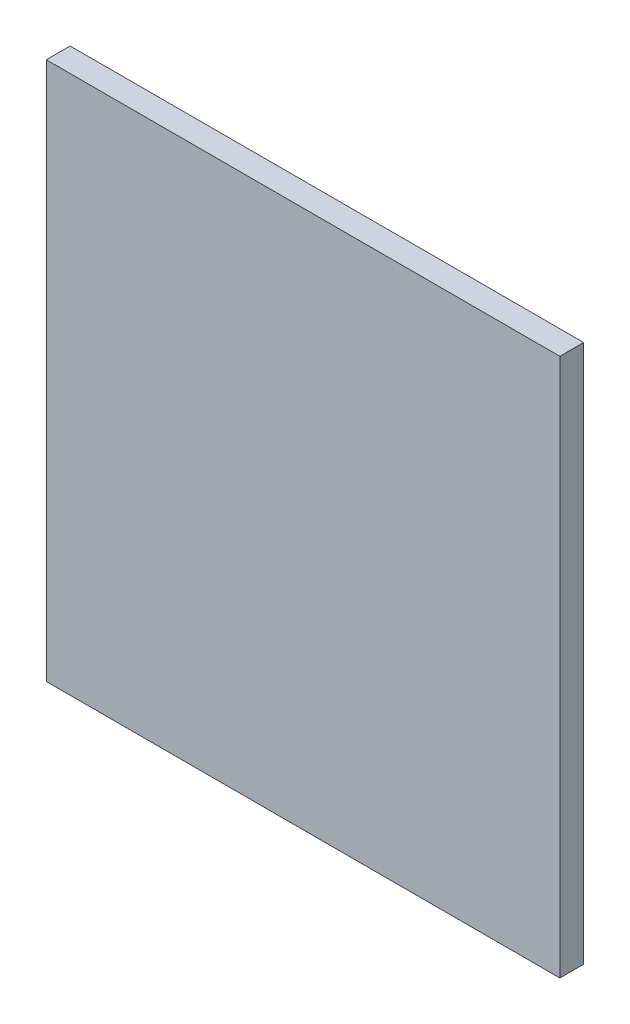
ISO-10303-21;
HEADER;
FILE_DESCRIPTION(('STEP AP214'),'2;1');
FILE_NAME('part.step','',(''),(''),'','','');
FILE_SCHEMA(('AUTOMOTIVE_DESIGN { 1 0 10303 214 1 1 1 1 }'));
ENDSEC;
DATA;
#1=APPLICATION_CONTEXT('core data for automotive mechanical design processes');
#2=APPLICATION_PROTOCOL_DEFINITION('international standard','automotive_design',2000,#1);
#3=PRODUCT_CONTEXT('',#1,'mechanical');
#4=PRODUCT('Part','Part','',(#3));
#5=PRODUCT_RELATED_PRODUCT_CATEGORY('part','',(#4));
#6=PRODUCT_DEFINITION_FORMATION('','',#4);
#7=PRODUCT_DEFINITION_CONTEXT('part definition',#1,'design');
#8=PRODUCT_DEFINITION('design','',#6,#7);
#9=PRODUCT_DEFINITION_SHAPE('','',#8);
#10=(LENGTH_UNIT() NAMED_UNIT(*) SI_UNIT(.MILLI.,.METRE.));
#11=(NAMED_UNIT(*) PLANE_ANGLE_UNIT() SI_UNIT($,.RADIAN.));
#12=(NAMED_UNIT(*) SI_UNIT($,.STERADIAN.) SOLID_ANGLE_UNIT());
#13=UNCERTAINTY_MEASURE_WITH_UNIT(LENGTH_MEASURE(1.E-05),#10,'distance_accuracy_value','');
#14=(GEOMETRIC_REPRESENTATION_CONTEXT(3) GLOBAL_UNCERTAINTY_ASSIGNED_CONTEXT((#13)) GLOBAL_UNIT_ASSIGNED_CONTEXT((#10,
#11,#12)) REPRESENTATION_CONTEXT('',''));
#15=CARTESIAN_POINT('',(0.,0.,0.));
#16=DIRECTION('',(0.,0.,1.));
#17=DIRECTION('',(1.,0.,0.));
#18=AXIS2_PLACEMENT_3D('',#15,#16,#17);
#19=CARTESIAN_POINT('',(-81.8675,-92.916604699861,0.762));
#20=DIRECTION('',(0.,1.,0.));
#21=DIRECTION('',(0.,0.,1.));
#22=AXIS2_PLACEMENT_3D('',#19,#20,#21);
#23=PLANE('',#22);
#24=DIRECTION('',(1.,0.,0.));
#25=VECTOR('',#24,1.);
#26=CARTESIAN_POINT('',(-81.8675,-92.916604699861,0.));
#27=LINE('',#26,#25);
#28=CARTESIAN_POINT('',(-81.8675,-92.916604699861,0.));
#29=VERTEX_POINT('',#28);
#30=CARTESIAN_POINT('',(-65.4525,-92.916604699861,0.));
#31=VERTEX_POINT('',#30);
#32=EDGE_CURVE('E96',#29,#31,#27,.T.);
#33=ORIENTED_EDGE('',*,*,#32,.T.);
#34=DIRECTION('',(0.,0.,-1.));
#35=VECTOR('',#34,1.);
#36=CARTESIAN_POINT('',(-65.4525,-92.916604699861,0.762));
#37=LINE('',#36,#35);
#38=CARTESIAN_POINT('',(-65.4525,-92.916604699861,0.762));
#39=VERTEX_POINT('',#38);
#40=EDGE_CURVE('E11',#39,#31,#37,.T.);
#41=ORIENTED_EDGE('',*,*,#40,.F.);
#42=DIRECTION('',(1.,0.,0.));
#43=VECTOR('',#42,1.);
#44=CARTESIAN_POINT('',(-81.8675,-92.916604699861,0.762));
#45=LINE('',#44,#43);
#46=CARTESIAN_POINT('',(-81.8675,-92.916604699861,0.762));
#47=VERTEX_POINT('',#46);
#48=EDGE_CURVE('E84',#47,#39,#45,.T.);
#49=ORIENTED_EDGE('',*,*,#48,.F.);
#50=DIRECTION('',(0.,0.,-1.));
#51=VECTOR('',#50,1.);
#52=CARTESIAN_POINT('',(-81.8675,-92.916604699861,0.762));
#53=LINE('',#52,#51);
#54=EDGE_CURVE('E92',#47,#29,#53,.T.);
#55=ORIENTED_EDGE('',*,*,#54,.T.);
#56=EDGE_LOOP('',(#33,#41,#49,#55));
#57=FACE_BOUND('',#56,.T.);
#58=ADVANCED_FACE('F33',(#57),#23,.F.);
#59=CARTESIAN_POINT('',(-65.4525,-92.916604699861,0.762));
#60=DIRECTION('',(-1.,0.,0.));
#61=DIRECTION('',(0.,0.,1.));
#62=AXIS2_PLACEMENT_3D('',#59,#60,#61);
#63=PLANE('',#62);
#64=DIRECTION('',(0.,1.,0.));
#65=VECTOR('',#64,1.);
#66=CARTESIAN_POINT('',(-65.4525,-92.916604699861,0.));
#67=LINE('',#66,#65);
#68=CARTESIAN_POINT('',(-65.4525,-75.7078546998609,0.));
#69=VERTEX_POINT('',#68);
#70=EDGE_CURVE('E88',#31,#69,#67,.T.);
#71=ORIENTED_EDGE('',*,*,#70,.T.);
#72=DIRECTION('',(0.,0.,-1.));
#73=VECTOR('',#72,1.);
#74=CARTESIAN_POINT('',(-65.4525,-75.7078546998609,0.762));
#75=LINE('',#74,#73);
#76=CARTESIAN_POINT('',(-65.4525,-75.7078546998609,0.762));
#77=VERTEX_POINT('',#76);
#78=EDGE_CURVE('E41',#77,#69,#75,.T.);
#79=ORIENTED_EDGE('',*,*,#78,.F.);
#80=DIRECTION('',(0.,1.,0.));
#81=VECTOR('',#80,1.);
#82=CARTESIAN_POINT('',(-65.4525,-92.916604699861,0.762));
#83=LINE('',#82,#81);
#84=EDGE_CURVE('E79',#39,#77,#83,.T.);
#85=ORIENTED_EDGE('',*,*,#84,.F.);
#86=ORIENTED_EDGE('',*,*,#40,.T.);
#87=EDGE_LOOP('',(#71,#79,#85,#86));
#88=FACE_BOUND('',#87,.T.);
#89=ADVANCED_FACE('F87',(#88),#63,.F.);
#90=CARTESIAN_POINT('',(-65.4525,-75.7078546998609,0.762));
#91=DIRECTION('',(0.,-1.,0.));
#92=DIRECTION('',(0.,0.,-1.));
#93=AXIS2_PLACEMENT_3D('',#90,#91,#92);
#94=PLANE('',#93);
#95=DIRECTION('',(-1.,0.,0.));
#96=VECTOR('',#95,1.);
#97=CARTESIAN_POINT('',(-65.4525,-75.7078546998609,0.));
#98=LINE('',#97,#96);
#99=CARTESIAN_POINT('',(-81.8675,-75.7078546998609,0.));
#100=VERTEX_POINT('',#99);
#101=EDGE_CURVE('E66',#69,#100,#98,.T.);
#102=ORIENTED_EDGE('',*,*,#101,.T.);
#103=DIRECTION('',(0.,0.,-1.));
#104=VECTOR('',#103,1.);
#105=CARTESIAN_POINT('',(-81.8675,-75.7078546998609,0.762));
#106=LINE('',#105,#104);
#107=CARTESIAN_POINT('',(-81.8675,-75.7078546998609,0.762));
#108=VERTEX_POINT('',#107);
#109=EDGE_CURVE('E89',#108,#100,#106,.T.);
#110=ORIENTED_EDGE('',*,*,#109,.F.);
#111=DIRECTION('',(-1.,0.,0.));
#112=VECTOR('',#111,1.);
#113=CARTESIAN_POINT('',(-65.4525,-75.7078546998609,0.762));
#114=LINE('',#113,#112);
#115=EDGE_CURVE('E82',#77,#108,#114,.T.);
#116=ORIENTED_EDGE('',*,*,#115,.F.);
#117=ORIENTED_EDGE('',*,*,#78,.T.);
#118=EDGE_LOOP('',(#102,#110,#116,#117));
#119=FACE_BOUND('',#118,.T.);
#120=ADVANCED_FACE('F90',(#119),#94,.F.);
#121=CARTESIAN_POINT('',(-81.8675,-75.7078546998609,0.762));
#122=DIRECTION('',(1.,0.,0.));
#123=DIRECTION('',(0.,0.,-1.));
#124=AXIS2_PLACEMENT_3D('',#121,#122,#123);
#125=PLANE('',#124);
#126=DIRECTION('',(0.,-1.,0.));
#127=VECTOR('',#126,1.);
#128=CARTESIAN_POINT('',(-81.8675,-75.7078546998609,0.));
#129=LINE('',#128,#127);
#130=EDGE_CURVE('E72',#100,#29,#129,.T.);
#131=ORIENTED_EDGE('',*,*,#130,.T.);
#132=ORIENTED_EDGE('',*,*,#54,.F.);
#133=DIRECTION('',(0.,-1.,0.));
#134=VECTOR('',#133,1.);
#135=CARTESIAN_POINT('',(-81.8675,-75.7078546998609,0.762));
#136=LINE('',#135,#134);
#137=EDGE_CURVE('E49',#108,#47,#136,.T.);
#138=ORIENTED_EDGE('',*,*,#137,.F.);
#139=ORIENTED_EDGE('',*,*,#109,.T.);
#140=EDGE_LOOP('',(#131,#132,#138,#139));
#141=FACE_BOUND('',#140,.T.);
#142=ADVANCED_FACE('F103',(#141),#125,.F.);
#143=CARTESIAN_POINT('',(0.,0.,0.762));
#144=DIRECTION('',(0.,0.,1.));
#145=DIRECTION('',(1.,0.,0.));
#146=AXIS2_PLACEMENT_3D('',#143,#144,#145);
#147=PLANE('',#146);
#148=ORIENTED_EDGE('',*,*,#48,.T.);
#149=ORIENTED_EDGE('',*,*,#84,.T.);
#150=ORIENTED_EDGE('',*,*,#115,.T.);
#151=ORIENTED_EDGE('',*,*,#137,.T.);
#152=EDGE_LOOP('',(#148,#149,#150,#151));
#153=FACE_BOUND('',#152,.T.);
#154=ADVANCED_FACE('F80',(#153),#147,.T.);
#155=CARTESIAN_POINT('',(0.,0.,0.));
#156=DIRECTION('',(0.,0.,1.));
#157=DIRECTION('',(1.,0.,0.));
#158=AXIS2_PLACEMENT_3D('',#155,#156,#157);
#159=PLANE('',#158);
#160=ORIENTED_EDGE('',*,*,#32,.F.);
#161=ORIENTED_EDGE('',*,*,#130,.F.);
#162=ORIENTED_EDGE('',*,*,#101,.F.);
#163=ORIENTED_EDGE('',*,*,#70,.F.);
#164=EDGE_LOOP('',(#160,#161,#162,#163));
#165=FACE_BOUND('',#164,.T.);
#166=ADVANCED_FACE('F106',(#165),#159,.F.);
#167=CLOSED_SHELL('',(#58,#89,#120,#142,#154,#166));
#168=MANIFOLD_SOLID_BREP('B2',#167);
#169=ADVANCED_BREP_SHAPE_REPRESENTATION('',(#18,#168),#14);
#170=SHAPE_DEFINITION_REPRESENTATION(#9,#169);
ENDSEC;
END-ISO-10303-21;
